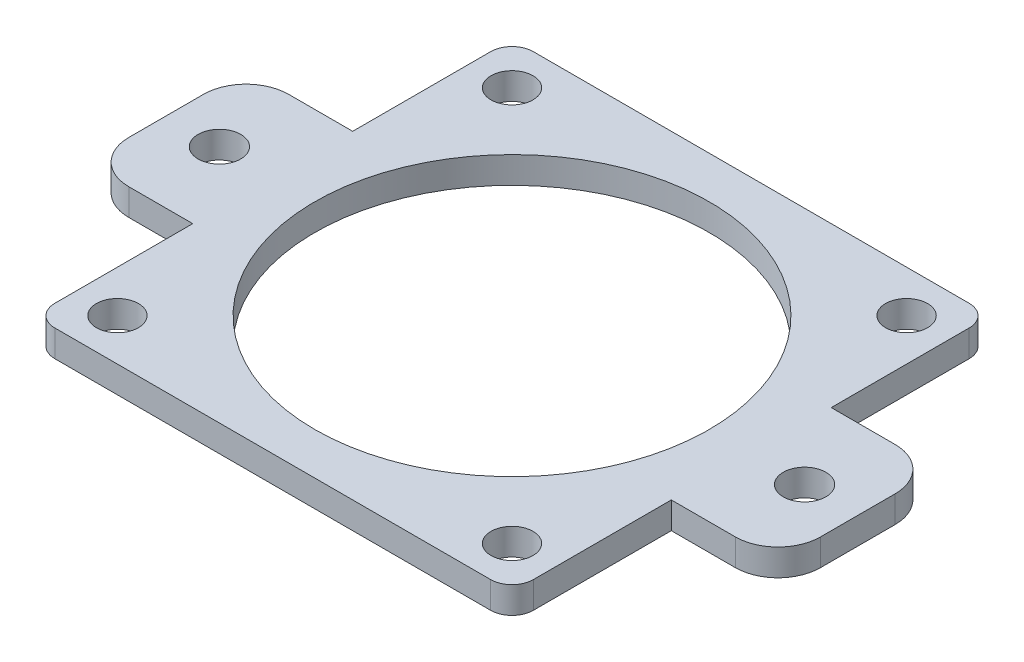
ISO-10303-21;
HEADER;
FILE_DESCRIPTION(('STEP AP214'),'2;1');
FILE_NAME('part.step','',(''),(''),'','','');
FILE_SCHEMA(('AUTOMOTIVE_DESIGN { 1 0 10303 214 1 1 1 1 }'));
ENDSEC;
DATA;
#1=APPLICATION_CONTEXT('core data for automotive mechanical design processes');
#2=APPLICATION_PROTOCOL_DEFINITION('international standard','automotive_design',2000,#1);
#3=PRODUCT_CONTEXT('',#1,'mechanical');
#4=PRODUCT('Part','Part','',(#3));
#5=PRODUCT_RELATED_PRODUCT_CATEGORY('part','',(#4));
#6=PRODUCT_DEFINITION_FORMATION('','',#4);
#7=PRODUCT_DEFINITION_CONTEXT('part definition',#1,'design');
#8=PRODUCT_DEFINITION('design','',#6,#7);
#9=PRODUCT_DEFINITION_SHAPE('','',#8);
#10=(LENGTH_UNIT() NAMED_UNIT(*) SI_UNIT(.MILLI.,.METRE.));
#11=(NAMED_UNIT(*) PLANE_ANGLE_UNIT() SI_UNIT($,.RADIAN.));
#12=(NAMED_UNIT(*) SI_UNIT($,.STERADIAN.) SOLID_ANGLE_UNIT());
#13=UNCERTAINTY_MEASURE_WITH_UNIT(LENGTH_MEASURE(1.E-05),#10,'distance_accuracy_value','');
#14=(GEOMETRIC_REPRESENTATION_CONTEXT(3) GLOBAL_UNCERTAINTY_ASSIGNED_CONTEXT((#13)) GLOBAL_UNIT_ASSIGNED_CONTEXT((#10,
#11,#12)) REPRESENTATION_CONTEXT('',''));
#15=CARTESIAN_POINT('',(0.,0.,0.));
#16=DIRECTION('',(0.,0.,1.));
#17=DIRECTION('',(1.,0.,0.));
#18=AXIS2_PLACEMENT_3D('',#15,#16,#17);
#19=CARTESIAN_POINT('',(25.9599938,3.175,-25.9599938));
#20=DIRECTION('',(0.,1.,0.));
#21=DIRECTION('',(0.,0.,1.));
#22=AXIS2_PLACEMENT_3D('',#19,#20,#21);
#23=PLANE('',#22);
#24=CARTESIAN_POINT('',(-34.8499938,3.175,0.));
#25=DIRECTION('',(0.,1.,0.));
#26=DIRECTION('',(0.,0.,1.));
#27=AXIS2_PLACEMENT_3D('',#24,#25,#26);
#28=CIRCLE('',#27,2.54);
#29=CARTESIAN_POINT('',(-34.8499938,3.175,2.54));
#30=VERTEX_POINT('',#29);
#31=EDGE_CURVE('E682',#30,#30,#28,.T.);
#32=ORIENTED_EDGE('',*,*,#31,.F.);
#33=EDGE_LOOP('',(#32));
#34=FACE_BOUND('',#33,.T.);
#35=CARTESIAN_POINT('',(23.5000038000013,3.175,23.5000037999987));
#36=DIRECTION('',(0.,1.,0.));
#37=DIRECTION('',(0.,0.,1.));
#38=AXIS2_PLACEMENT_3D('',#35,#36,#37);
#39=CIRCLE('',#38,2.49999500000186);
#40=CARTESIAN_POINT('',(23.5000038000013,3.175,25.9999988000005));
#41=VERTEX_POINT('',#40);
#42=EDGE_CURVE('E694',#41,#41,#39,.T.);
#43=ORIENTED_EDGE('',*,*,#42,.F.);
#44=EDGE_LOOP('',(#43));
#45=FACE_BOUND('',#44,.T.);
#46=CARTESIAN_POINT('',(-23.5000038,3.175,-23.5000038));
#47=DIRECTION('',(0.,1.,0.));
#48=DIRECTION('',(0.,0.,1.));
#49=AXIS2_PLACEMENT_3D('',#46,#47,#48);
#50=CIRCLE('',#49,2.499995);
#51=CARTESIAN_POINT('',(-23.5000038,3.175,-21.0000088));
#52=VERTEX_POINT('',#51);
#53=EDGE_CURVE('E706',#52,#52,#50,.T.);
#54=ORIENTED_EDGE('',*,*,#53,.F.);
#55=EDGE_LOOP('',(#54));
#56=FACE_BOUND('',#55,.T.);
#57=DIRECTION('',(-1.,0.,0.));
#58=VECTOR('',#57,1.);
#59=CARTESIAN_POINT('',(-13.9933145966194,3.175,-28.4999938));
#60=LINE('',#59,#58);
#61=CARTESIAN_POINT('',(25.9599938,3.175,-28.4999938));
#62=VERTEX_POINT('',#61);
#63=CARTESIAN_POINT('',(-25.9599938,3.175,-28.4999938));
#64=VERTEX_POINT('',#63);
#65=EDGE_CURVE('E52',#62,#64,#60,.T.);
#66=ORIENTED_EDGE('',*,*,#65,.T.);
#67=CARTESIAN_POINT('',(-25.9599938,3.175,-25.9599938));
#68=DIRECTION('',(0.,1.,0.));
#69=DIRECTION('',(0.,0.,1.));
#70=AXIS2_PLACEMENT_3D('',#67,#68,#69);
#71=CIRCLE('',#70,2.54);
#72=CARTESIAN_POINT('',(-28.4999938,3.175,-25.9599938));
#73=VERTEX_POINT('',#72);
#74=EDGE_CURVE('E299',#64,#73,#71,.T.);
#75=ORIENTED_EDGE('',*,*,#74,.T.);
#76=DIRECTION('',(0.,0.,1.));
#77=VECTOR('',#76,1.);
#78=CARTESIAN_POINT('',(-28.4999938,3.175,-13.9933145966194));
#79=LINE('',#78,#77);
#80=CARTESIAN_POINT('',(-28.4999938,3.175,-9.525));
#81=VERTEX_POINT('',#80);
#82=EDGE_CURVE('E296',#73,#81,#79,.T.);
#83=ORIENTED_EDGE('',*,*,#82,.T.);
#84=DIRECTION('',(-1.,0.,0.));
#85=VECTOR('',#84,1.);
#86=CARTESIAN_POINT('',(-28.4999938,3.175,-9.525));
#87=LINE('',#86,#85);
#88=CARTESIAN_POINT('',(-36.1199938,3.175,-9.525));
#89=VERTEX_POINT('',#88);
#90=EDGE_CURVE('E319',#81,#89,#87,.T.);
#91=ORIENTED_EDGE('',*,*,#90,.T.);
#92=CARTESIAN_POINT('',(-36.1199938,3.175,-4.445));
#93=DIRECTION('',(0.,1.,0.));
#94=DIRECTION('',(0.,0.,1.));
#95=AXIS2_PLACEMENT_3D('',#92,#93,#94);
#96=CIRCLE('',#95,5.08);
#97=CARTESIAN_POINT('',(-41.1999938,3.175,-4.44499999999996));
#98=VERTEX_POINT('',#97);
#99=EDGE_CURVE('E316',#89,#98,#96,.T.);
#100=ORIENTED_EDGE('',*,*,#99,.T.);
#101=DIRECTION('',(0.,0.,1.));
#102=VECTOR('',#101,1.);
#103=CARTESIAN_POINT('',(-41.1999938,3.175,4.44499999999997));
#104=LINE('',#103,#102);
#105=CARTESIAN_POINT('',(-41.1999938,3.175,4.44499999999997));
#106=VERTEX_POINT('',#105);
#107=EDGE_CURVE('E318',#98,#106,#104,.T.);
#108=ORIENTED_EDGE('',*,*,#107,.T.);
#109=CARTESIAN_POINT('',(-36.1199938,3.175,4.44500000000001));
#110=DIRECTION('',(0.,1.,0.));
#111=DIRECTION('',(0.,0.,-1.));
#112=AXIS2_PLACEMENT_3D('',#109,#110,#111);
#113=CIRCLE('',#112,5.08);
#114=CARTESIAN_POINT('',(-36.1199938,3.175,9.525));
#115=VERTEX_POINT('',#114);
#116=EDGE_CURVE('E321',#106,#115,#113,.T.);
#117=ORIENTED_EDGE('',*,*,#116,.T.);
#118=DIRECTION('',(1.,0.,0.));
#119=VECTOR('',#118,1.);
#120=CARTESIAN_POINT('',(-28.4999938,3.175,9.52500000000001));
#121=LINE('',#120,#119);
#122=CARTESIAN_POINT('',(-28.4999938,3.175,9.52500000000001));
#123=VERTEX_POINT('',#122);
#124=EDGE_CURVE('E327',#115,#123,#121,.T.);
#125=ORIENTED_EDGE('',*,*,#124,.T.);
#126=DIRECTION('',(0.,0.,1.));
#127=VECTOR('',#126,1.);
#128=CARTESIAN_POINT('',(-28.4999938,3.175,9.52500000000001));
#129=LINE('',#128,#127);
#130=CARTESIAN_POINT('',(-28.4999938,3.175,25.9599938));
#131=VERTEX_POINT('',#130);
#132=EDGE_CURVE('E329',#123,#131,#129,.T.);
#133=ORIENTED_EDGE('',*,*,#132,.T.);
#134=CARTESIAN_POINT('',(-25.9599938,3.175,25.9599938));
#135=DIRECTION('',(0.,1.,0.));
#136=DIRECTION('',(0.,0.,-1.));
#137=AXIS2_PLACEMENT_3D('',#134,#135,#136);
#138=CIRCLE('',#137,2.54);
#139=CARTESIAN_POINT('',(-25.9599938,3.175,28.4999938));
#140=VERTEX_POINT('',#139);
#141=EDGE_CURVE('E331',#131,#140,#138,.T.);
#142=ORIENTED_EDGE('',*,*,#141,.T.);
#143=DIRECTION('',(1.,0.,0.));
#144=VECTOR('',#143,1.);
#145=CARTESIAN_POINT('',(-13.9933145966194,3.175,28.4999938));
#146=LINE('',#145,#144);
#147=CARTESIAN_POINT('',(25.9599938,3.175,28.4999938));
#148=VERTEX_POINT('',#147);
#149=EDGE_CURVE('E333',#140,#148,#146,.T.);
#150=ORIENTED_EDGE('',*,*,#149,.T.);
#151=CARTESIAN_POINT('',(25.9599938,3.175,25.9599938));
#152=DIRECTION('',(0.,1.,0.));
#153=DIRECTION('',(0.,0.,1.));
#154=AXIS2_PLACEMENT_3D('',#151,#152,#153);
#155=CIRCLE('',#154,2.54);
#156=CARTESIAN_POINT('',(28.4999938,3.175,25.9599938));
#157=VERTEX_POINT('',#156);
#158=EDGE_CURVE('E335',#148,#157,#155,.T.);
#159=ORIENTED_EDGE('',*,*,#158,.T.);
#160=DIRECTION('',(0.,0.,-1.));
#161=VECTOR('',#160,1.);
#162=CARTESIAN_POINT('',(28.4999938,3.175,25.9599938));
#163=LINE('',#162,#161);
#164=CARTESIAN_POINT('',(28.4999938,3.175,9.525));
#165=VERTEX_POINT('',#164);
#166=EDGE_CURVE('E337',#157,#165,#163,.T.);
#167=ORIENTED_EDGE('',*,*,#166,.T.);
#168=DIRECTION('',(1.,0.,0.));
#169=VECTOR('',#168,1.);
#170=CARTESIAN_POINT('',(28.4999938,3.175,9.525));
#171=LINE('',#170,#169);
#172=CARTESIAN_POINT('',(36.1199938,3.175,9.525));
#173=VERTEX_POINT('',#172);
#174=EDGE_CURVE('E339',#165,#173,#171,.T.);
#175=ORIENTED_EDGE('',*,*,#174,.T.);
#176=CARTESIAN_POINT('',(36.1199938,3.175,4.445));
#177=DIRECTION('',(0.,1.,0.));
#178=DIRECTION('',(0.,0.,1.));
#179=AXIS2_PLACEMENT_3D('',#176,#177,#178);
#180=CIRCLE('',#179,5.08);
#181=CARTESIAN_POINT('',(41.1999938,3.175,4.44499999999996));
#182=VERTEX_POINT('',#181);
#183=EDGE_CURVE('E341',#173,#182,#180,.T.);
#184=ORIENTED_EDGE('',*,*,#183,.T.);
#185=DIRECTION('',(0.,0.,-1.));
#186=VECTOR('',#185,1.);
#187=CARTESIAN_POINT('',(41.1999938,3.175,4.44499999999996));
#188=LINE('',#187,#186);
#189=CARTESIAN_POINT('',(41.1999938,3.175,-4.44499999999998));
#190=VERTEX_POINT('',#189);
#191=EDGE_CURVE('E343',#182,#190,#188,.T.);
#192=ORIENTED_EDGE('',*,*,#191,.T.);
#193=CARTESIAN_POINT('',(36.1199938,3.175,-4.44500000000001));
#194=DIRECTION('',(0.,1.,0.));
#195=DIRECTION('',(0.,0.,1.));
#196=AXIS2_PLACEMENT_3D('',#193,#194,#195);
#197=CIRCLE('',#196,5.08);
#198=CARTESIAN_POINT('',(36.1199938,3.175,-9.52500000000001));
#199=VERTEX_POINT('',#198);
#200=EDGE_CURVE('E183',#190,#199,#197,.T.);
#201=ORIENTED_EDGE('',*,*,#200,.T.);
#202=DIRECTION('',(-1.,0.,0.));
#203=VECTOR('',#202,1.);
#204=CARTESIAN_POINT('',(28.4999938,3.175,-9.525));
#205=LINE('',#204,#203);
#206=CARTESIAN_POINT('',(28.4999938,3.175,-9.525));
#207=VERTEX_POINT('',#206);
#208=EDGE_CURVE('E177',#199,#207,#205,.T.);
#209=ORIENTED_EDGE('',*,*,#208,.T.);
#210=DIRECTION('',(0.,0.,-1.));
#211=VECTOR('',#210,1.);
#212=CARTESIAN_POINT('',(28.4999938,3.175,-13.9933145966194));
#213=LINE('',#212,#211);
#214=CARTESIAN_POINT('',(28.4999938,3.175,-25.9599938));
#215=VERTEX_POINT('',#214);
#216=EDGE_CURVE('E181',#207,#215,#213,.T.);
#217=ORIENTED_EDGE('',*,*,#216,.T.);
#218=CARTESIAN_POINT('',(25.9599938,3.175,-25.9599938));
#219=DIRECTION('',(0.,1.,0.));
#220=DIRECTION('',(0.,0.,1.));
#221=AXIS2_PLACEMENT_3D('',#218,#219,#220);
#222=CIRCLE('',#221,2.54);
#223=EDGE_CURVE('E198',#215,#62,#222,.T.);
#224=ORIENTED_EDGE('',*,*,#223,.T.);
#225=EDGE_LOOP('',(#66,#75,#83,#91,#100,#108,#117,#125,#133,#142,#150,#159,#167,#175,#184,#192,
#201,#209,#217,#224));
#226=FACE_BOUND('',#225,.T.);
#227=CARTESIAN_POINT('',(0.,3.175,0.));
#228=DIRECTION('',(0.,1.,0.));
#229=DIRECTION('',(0.,0.,1.));
#230=AXIS2_PLACEMENT_3D('',#227,#228,#229);
#231=CIRCLE('',#230,23.495);
#232=CARTESIAN_POINT('',(0.,3.175,23.495));
#233=VERTEX_POINT('',#232);
#234=EDGE_CURVE('E208',#233,#233,#231,.T.);
#235=ORIENTED_EDGE('',*,*,#234,.F.);
#236=EDGE_LOOP('',(#235));
#237=FACE_BOUND('',#236,.T.);
#238=CARTESIAN_POINT('',(23.5000038,3.175,-23.5000038000013));
#239=DIRECTION('',(0.,1.,0.));
#240=DIRECTION('',(0.,0.,1.));
#241=AXIS2_PLACEMENT_3D('',#238,#239,#240);
#242=CIRCLE('',#241,2.49999500000137);
#243=CARTESIAN_POINT('',(23.5000038,3.175,-21.0000088));
#244=VERTEX_POINT('',#243);
#245=EDGE_CURVE('E700',#244,#244,#242,.T.);
#246=ORIENTED_EDGE('',*,*,#245,.F.);
#247=EDGE_LOOP('',(#246));
#248=FACE_BOUND('',#247,.T.);
#249=CARTESIAN_POINT('',(-23.5000037999987,3.175,23.5000038));
#250=DIRECTION('',(0.,1.,0.));
#251=DIRECTION('',(0.,0.,1.));
#252=AXIS2_PLACEMENT_3D('',#249,#250,#251);
#253=CIRCLE('',#252,2.49999500000069);
#254=CARTESIAN_POINT('',(-23.5000037999987,3.175,25.9999988000007));
#255=VERTEX_POINT('',#254);
#256=EDGE_CURVE('E688',#255,#255,#253,.T.);
#257=ORIENTED_EDGE('',*,*,#256,.F.);
#258=EDGE_LOOP('',(#257));
#259=FACE_BOUND('',#258,.T.);
#260=CARTESIAN_POINT('',(34.8499938,3.175,0.));
#261=DIRECTION('',(0.,1.,0.));
#262=DIRECTION('',(0.,0.,-1.));
#263=AXIS2_PLACEMENT_3D('',#260,#261,#262);
#264=CIRCLE('',#263,2.54000000000002);
#265=CARTESIAN_POINT('',(34.8499938,3.175,-2.54000000000002));
#266=VERTEX_POINT('',#265);
#267=EDGE_CURVE('E673',#266,#266,#264,.T.);
#268=ORIENTED_EDGE('',*,*,#267,.F.);
#269=EDGE_LOOP('',(#268));
#270=FACE_BOUND('',#269,.T.);
#271=ADVANCED_FACE('F35',(#34,#45,#56,#226,#237,#248,#259,#270),#23,.T.);
#272=CARTESIAN_POINT('',(25.9599938,0.,-25.9599938));
#273=DIRECTION('',(0.,1.,0.));
#274=DIRECTION('',(0.,0.,1.));
#275=AXIS2_PLACEMENT_3D('',#272,#273,#274);
#276=PLANE('',#275);
#277=CARTESIAN_POINT('',(-25.9599938,0.,-25.9599938));
#278=DIRECTION('',(0.,1.,0.));
#279=DIRECTION('',(0.,0.,1.));
#280=AXIS2_PLACEMENT_3D('',#277,#278,#279);
#281=CIRCLE('',#280,2.54);
#282=CARTESIAN_POINT('',(-25.9599938,0.,-28.4999938));
#283=VERTEX_POINT('',#282);
#284=CARTESIAN_POINT('',(-28.4999938,0.,-25.9599938));
#285=VERTEX_POINT('',#284);
#286=EDGE_CURVE('E204',#283,#285,#281,.T.);
#287=ORIENTED_EDGE('',*,*,#286,.F.);
#288=DIRECTION('',(-1.,0.,0.));
#289=VECTOR('',#288,1.);
#290=CARTESIAN_POINT('',(25.9599938,0.,-28.4999938));
#291=LINE('',#290,#289);
#292=CARTESIAN_POINT('',(25.9599938,0.,-28.4999938));
#293=VERTEX_POINT('',#292);
#294=EDGE_CURVE('E244',#293,#283,#291,.T.);
#295=ORIENTED_EDGE('',*,*,#294,.F.);
#296=CARTESIAN_POINT('',(25.9599938,0.,-25.9599938));
#297=DIRECTION('',(0.,1.,0.));
#298=DIRECTION('',(0.,0.,1.));
#299=AXIS2_PLACEMENT_3D('',#296,#297,#298);
#300=CIRCLE('',#299,2.54);
#301=CARTESIAN_POINT('',(28.4999938,0.,-25.9599938));
#302=VERTEX_POINT('',#301);
#303=EDGE_CURVE('E124',#302,#293,#300,.T.);
#304=ORIENTED_EDGE('',*,*,#303,.F.);
#305=DIRECTION('',(0.,0.,-1.));
#306=VECTOR('',#305,1.);
#307=CARTESIAN_POINT('',(28.4999938,0.,-13.9933145966194));
#308=LINE('',#307,#306);
#309=CARTESIAN_POINT('',(28.4999938,0.,-9.525));
#310=VERTEX_POINT('',#309);
#311=EDGE_CURVE('E117',#310,#302,#308,.T.);
#312=ORIENTED_EDGE('',*,*,#311,.F.);
#313=DIRECTION('',(-1.,0.,0.));
#314=VECTOR('',#313,1.);
#315=CARTESIAN_POINT('',(28.4999938,0.,-9.525));
#316=LINE('',#315,#314);
#317=CARTESIAN_POINT('',(36.1199938,0.,-9.52500000000001));
#318=VERTEX_POINT('',#317);
#319=EDGE_CURVE('E192',#318,#310,#316,.T.);
#320=ORIENTED_EDGE('',*,*,#319,.F.);
#321=CARTESIAN_POINT('',(36.1199938,0.,-4.44500000000001));
#322=DIRECTION('',(0.,1.,0.));
#323=DIRECTION('',(0.,0.,1.));
#324=AXIS2_PLACEMENT_3D('',#321,#322,#323);
#325=CIRCLE('',#324,5.08);
#326=CARTESIAN_POINT('',(41.1999938,0.,-4.44499999999998));
#327=VERTEX_POINT('',#326);
#328=EDGE_CURVE('E239',#327,#318,#325,.T.);
#329=ORIENTED_EDGE('',*,*,#328,.F.);
#330=DIRECTION('',(0.,0.,-1.));
#331=VECTOR('',#330,1.);
#332=CARTESIAN_POINT('',(41.1999938,0.,4.44499999999996));
#333=LINE('',#332,#331);
#334=CARTESIAN_POINT('',(41.1999938,0.,4.44499999999996));
#335=VERTEX_POINT('',#334);
#336=EDGE_CURVE('E237',#335,#327,#333,.T.);
#337=ORIENTED_EDGE('',*,*,#336,.F.);
#338=CARTESIAN_POINT('',(36.1199938,0.,4.445));
#339=DIRECTION('',(0.,1.,0.));
#340=DIRECTION('',(0.,0.,1.));
#341=AXIS2_PLACEMENT_3D('',#338,#339,#340);
#342=CIRCLE('',#341,5.08);
#343=CARTESIAN_POINT('',(36.1199938,0.,9.525));
#344=VERTEX_POINT('',#343);
#345=EDGE_CURVE('E235',#344,#335,#342,.T.);
#346=ORIENTED_EDGE('',*,*,#345,.F.);
#347=DIRECTION('',(1.,0.,0.));
#348=VECTOR('',#347,1.);
#349=CARTESIAN_POINT('',(28.4999938,0.,9.525));
#350=LINE('',#349,#348);
#351=CARTESIAN_POINT('',(28.4999938,0.,9.525));
#352=VERTEX_POINT('',#351);
#353=EDGE_CURVE('E233',#352,#344,#350,.T.);
#354=ORIENTED_EDGE('',*,*,#353,.F.);
#355=DIRECTION('',(0.,0.,-1.));
#356=VECTOR('',#355,1.);
#357=CARTESIAN_POINT('',(28.4999938,0.,9.525));
#358=LINE('',#357,#356);
#359=CARTESIAN_POINT('',(28.4999938,0.,25.9599938));
#360=VERTEX_POINT('',#359);
#361=EDGE_CURVE('E231',#360,#352,#358,.T.);
#362=ORIENTED_EDGE('',*,*,#361,.F.);
#363=CARTESIAN_POINT('',(25.9599938,0.,25.9599938));
#364=DIRECTION('',(0.,1.,0.));
#365=DIRECTION('',(0.,0.,1.));
#366=AXIS2_PLACEMENT_3D('',#363,#364,#365);
#367=CIRCLE('',#366,2.54);
#368=CARTESIAN_POINT('',(25.9599938,0.,28.4999938));
#369=VERTEX_POINT('',#368);
#370=EDGE_CURVE('E228',#369,#360,#367,.T.);
#371=ORIENTED_EDGE('',*,*,#370,.F.);
#372=DIRECTION('',(1.,0.,0.));
#373=VECTOR('',#372,1.);
#374=CARTESIAN_POINT('',(25.9599938,0.,28.4999938));
#375=LINE('',#374,#373);
#376=CARTESIAN_POINT('',(-25.9599938,0.,28.4999938));
#377=VERTEX_POINT('',#376);
#378=EDGE_CURVE('E226',#377,#369,#375,.T.);
#379=ORIENTED_EDGE('',*,*,#378,.F.);
#380=CARTESIAN_POINT('',(-25.9599938,0.,25.9599938));
#381=DIRECTION('',(0.,1.,0.));
#382=DIRECTION('',(0.,0.,-1.));
#383=AXIS2_PLACEMENT_3D('',#380,#381,#382);
#384=CIRCLE('',#383,2.54);
#385=CARTESIAN_POINT('',(-28.4999938,0.,25.9599938));
#386=VERTEX_POINT('',#385);
#387=EDGE_CURVE('E223',#386,#377,#384,.T.);
#388=ORIENTED_EDGE('',*,*,#387,.F.);
#389=DIRECTION('',(0.,0.,1.));
#390=VECTOR('',#389,1.);
#391=CARTESIAN_POINT('',(-28.4999938,0.,25.9599938));
#392=LINE('',#391,#390);
#393=CARTESIAN_POINT('',(-28.4999938,0.,9.52500000000001));
#394=VERTEX_POINT('',#393);
#395=EDGE_CURVE('E221',#394,#386,#392,.T.);
#396=ORIENTED_EDGE('',*,*,#395,.F.);
#397=DIRECTION('',(1.,0.,0.));
#398=VECTOR('',#397,1.);
#399=CARTESIAN_POINT('',(-28.4999938,0.,9.52500000000001));
#400=LINE('',#399,#398);
#401=CARTESIAN_POINT('',(-36.1199938,0.,9.525));
#402=VERTEX_POINT('',#401);
#403=EDGE_CURVE('E218',#402,#394,#400,.T.);
#404=ORIENTED_EDGE('',*,*,#403,.F.);
#405=CARTESIAN_POINT('',(-36.1199938,0.,4.44500000000001));
#406=DIRECTION('',(0.,1.,0.));
#407=DIRECTION('',(0.,0.,-1.));
#408=AXIS2_PLACEMENT_3D('',#405,#406,#407);
#409=CIRCLE('',#408,5.08);
#410=CARTESIAN_POINT('',(-41.1999938,0.,4.44499999999997));
#411=VERTEX_POINT('',#410);
#412=EDGE_CURVE('E216',#411,#402,#409,.T.);
#413=ORIENTED_EDGE('',*,*,#412,.F.);
#414=DIRECTION('',(0.,0.,1.));
#415=VECTOR('',#414,1.);
#416=CARTESIAN_POINT('',(-41.1999938,0.,4.44499999999997));
#417=LINE('',#416,#415);
#418=CARTESIAN_POINT('',(-41.1999938,0.,-4.44499999999996));
#419=VERTEX_POINT('',#418);
#420=EDGE_CURVE('E214',#419,#411,#417,.T.);
#421=ORIENTED_EDGE('',*,*,#420,.F.);
#422=CARTESIAN_POINT('',(-36.1199938,0.,-4.445));
#423=DIRECTION('',(0.,1.,0.));
#424=DIRECTION('',(0.,0.,1.));
#425=AXIS2_PLACEMENT_3D('',#422,#423,#424);
#426=CIRCLE('',#425,5.08);
#427=CARTESIAN_POINT('',(-36.1199938,0.,-9.525));
#428=VERTEX_POINT('',#427);
#429=EDGE_CURVE('E212',#428,#419,#426,.T.);
#430=ORIENTED_EDGE('',*,*,#429,.F.);
#431=DIRECTION('',(-1.,0.,0.));
#432=VECTOR('',#431,1.);
#433=CARTESIAN_POINT('',(-28.4999938,0.,-9.525));
#434=LINE('',#433,#432);
#435=CARTESIAN_POINT('',(-28.4999938,0.,-9.525));
#436=VERTEX_POINT('',#435);
#437=EDGE_CURVE('E210',#436,#428,#434,.T.);
#438=ORIENTED_EDGE('',*,*,#437,.F.);
#439=DIRECTION('',(0.,0.,1.));
#440=VECTOR('',#439,1.);
#441=CARTESIAN_POINT('',(-28.4999938,0.,-13.9933145966194));
#442=LINE('',#441,#440);
#443=EDGE_CURVE('E207',#285,#436,#442,.T.);
#444=ORIENTED_EDGE('',*,*,#443,.F.);
#445=EDGE_LOOP('',(#287,#295,#304,#312,#320,#329,#337,#346,#354,#362,#371,#379,#388,#396,#404,
#413,#421,#430,#438,#444));
#446=FACE_BOUND('',#445,.T.);
#447=CARTESIAN_POINT('',(0.,0.,0.));
#448=DIRECTION('',(0.,1.,0.));
#449=DIRECTION('',(0.,0.,1.));
#450=AXIS2_PLACEMENT_3D('',#447,#448,#449);
#451=CIRCLE('',#450,23.495);
#452=CARTESIAN_POINT('',(0.,0.,23.495));
#453=VERTEX_POINT('',#452);
#454=EDGE_CURVE('E709',#453,#453,#451,.T.);
#455=ORIENTED_EDGE('',*,*,#454,.T.);
#456=EDGE_LOOP('',(#455));
#457=FACE_BOUND('',#456,.T.);
#458=CARTESIAN_POINT('',(-23.5000038,0.,-23.5000038));
#459=DIRECTION('',(0.,1.,0.));
#460=DIRECTION('',(0.,0.,1.));
#461=AXIS2_PLACEMENT_3D('',#458,#459,#460);
#462=CIRCLE('',#461,2.499995);
#463=CARTESIAN_POINT('',(-23.5000038,0.,-21.0000088));
#464=VERTEX_POINT('',#463);
#465=EDGE_CURVE('E703',#464,#464,#462,.T.);
#466=ORIENTED_EDGE('',*,*,#465,.T.);
#467=EDGE_LOOP('',(#466));
#468=FACE_BOUND('',#467,.T.);
#469=CARTESIAN_POINT('',(23.5000038,0.,-23.5000038000013));
#470=DIRECTION('',(0.,1.,0.));
#471=DIRECTION('',(0.,0.,1.));
#472=AXIS2_PLACEMENT_3D('',#469,#470,#471);
#473=CIRCLE('',#472,2.49999500000137);
#474=CARTESIAN_POINT('',(23.5000038,0.,-21.0000088));
#475=VERTEX_POINT('',#474);
#476=EDGE_CURVE('E697',#475,#475,#473,.T.);
#477=ORIENTED_EDGE('',*,*,#476,.T.);
#478=EDGE_LOOP('',(#477));
#479=FACE_BOUND('',#478,.T.);
#480=CARTESIAN_POINT('',(23.5000038000013,0.,23.5000037999987));
#481=DIRECTION('',(0.,1.,0.));
#482=DIRECTION('',(0.,0.,1.));
#483=AXIS2_PLACEMENT_3D('',#480,#481,#482);
#484=CIRCLE('',#483,2.49999500000186);
#485=CARTESIAN_POINT('',(23.5000038000013,0.,25.9999988000005));
#486=VERTEX_POINT('',#485);
#487=EDGE_CURVE('E691',#486,#486,#484,.T.);
#488=ORIENTED_EDGE('',*,*,#487,.T.);
#489=EDGE_LOOP('',(#488));
#490=FACE_BOUND('',#489,.T.);
#491=CARTESIAN_POINT('',(-23.5000037999987,0.,23.5000038));
#492=DIRECTION('',(0.,1.,0.));
#493=DIRECTION('',(0.,0.,1.));
#494=AXIS2_PLACEMENT_3D('',#491,#492,#493);
#495=CIRCLE('',#494,2.49999500000069);
#496=CARTESIAN_POINT('',(-23.5000037999987,0.,25.9999988000007));
#497=VERTEX_POINT('',#496);
#498=EDGE_CURVE('E685',#497,#497,#495,.T.);
#499=ORIENTED_EDGE('',*,*,#498,.T.);
#500=EDGE_LOOP('',(#499));
#501=FACE_BOUND('',#500,.T.);
#502=CARTESIAN_POINT('',(-34.8499938,0.,0.));
#503=DIRECTION('',(0.,1.,0.));
#504=DIRECTION('',(0.,0.,1.));
#505=AXIS2_PLACEMENT_3D('',#502,#503,#504);
#506=CIRCLE('',#505,2.54);
#507=CARTESIAN_POINT('',(-34.8499938,0.,2.54));
#508=VERTEX_POINT('',#507);
#509=EDGE_CURVE('E679',#508,#508,#506,.T.);
#510=ORIENTED_EDGE('',*,*,#509,.T.);
#511=EDGE_LOOP('',(#510));
#512=FACE_BOUND('',#511,.T.);
#513=CARTESIAN_POINT('',(34.8499938,0.,0.));
#514=DIRECTION('',(0.,1.,0.));
#515=DIRECTION('',(0.,0.,-1.));
#516=AXIS2_PLACEMENT_3D('',#513,#514,#515);
#517=CIRCLE('',#516,2.54000000000002);
#518=CARTESIAN_POINT('',(34.8499938,0.,-2.54000000000002));
#519=VERTEX_POINT('',#518);
#520=EDGE_CURVE('E676',#519,#519,#517,.T.);
#521=ORIENTED_EDGE('',*,*,#520,.T.);
#522=EDGE_LOOP('',(#521));
#523=FACE_BOUND('',#522,.T.);
#524=ADVANCED_FACE('F303',(#446,#457,#468,#479,#490,#501,#512,#523),#276,.F.);
#525=CARTESIAN_POINT('',(-25.9599938,3.175,-25.9599938));
#526=DIRECTION('',(0.,-1.,0.));
#527=DIRECTION('',(0.,0.,-1.));
#528=AXIS2_PLACEMENT_3D('',#525,#526,#527);
#529=CYLINDRICAL_SURFACE('',#528,2.54);
#530=ORIENTED_EDGE('',*,*,#286,.T.);
#531=DIRECTION('',(0.,-1.,0.));
#532=VECTOR('',#531,1.);
#533=CARTESIAN_POINT('',(-28.4999938,3.175,-25.9599938));
#534=LINE('',#533,#532);
#535=EDGE_CURVE('E44',#73,#285,#534,.T.);
#536=ORIENTED_EDGE('',*,*,#535,.F.);
#537=ORIENTED_EDGE('',*,*,#74,.F.);
#538=DIRECTION('',(0.,-1.,0.));
#539=VECTOR('',#538,1.);
#540=CARTESIAN_POINT('',(-25.9599938,3.175,-28.4999938));
#541=LINE('',#540,#539);
#542=EDGE_CURVE('E11',#64,#283,#541,.T.);
#543=ORIENTED_EDGE('',*,*,#542,.T.);
#544=EDGE_LOOP('',(#530,#536,#537,#543));
#545=FACE_BOUND('',#544,.T.);
#546=ADVANCED_FACE('F37',(#545),#529,.T.);
#547=CARTESIAN_POINT('',(-28.4999938,3.175,-13.9933145966194));
#548=DIRECTION('',(1.,0.,0.));
#549=DIRECTION('',(0.,0.,-1.));
#550=AXIS2_PLACEMENT_3D('',#547,#548,#549);
#551=PLANE('',#550);
#552=ORIENTED_EDGE('',*,*,#443,.T.);
#553=DIRECTION('',(0.,-1.,0.));
#554=VECTOR('',#553,1.);
#555=CARTESIAN_POINT('',(-28.4999938,3.175,-9.525));
#556=LINE('',#555,#554);
#557=EDGE_CURVE('E288',#81,#436,#556,.T.);
#558=ORIENTED_EDGE('',*,*,#557,.F.);
#559=ORIENTED_EDGE('',*,*,#82,.F.);
#560=ORIENTED_EDGE('',*,*,#535,.T.);
#561=EDGE_LOOP('',(#552,#558,#559,#560));
#562=FACE_BOUND('',#561,.T.);
#563=ADVANCED_FACE('F294',(#562),#551,.F.);
#564=CARTESIAN_POINT('',(-28.4999938,3.175,-9.525));
#565=DIRECTION('',(0.,0.,1.));
#566=DIRECTION('',(1.,0.,0.));
#567=AXIS2_PLACEMENT_3D('',#564,#565,#566);
#568=PLANE('',#567);
#569=ORIENTED_EDGE('',*,*,#437,.T.);
#570=DIRECTION('',(0.,-1.,0.));
#571=VECTOR('',#570,1.);
#572=CARTESIAN_POINT('',(-36.1199938,3.175,-9.525));
#573=LINE('',#572,#571);
#574=EDGE_CURVE('E285',#89,#428,#573,.T.);
#575=ORIENTED_EDGE('',*,*,#574,.F.);
#576=ORIENTED_EDGE('',*,*,#90,.F.);
#577=ORIENTED_EDGE('',*,*,#557,.T.);
#578=EDGE_LOOP('',(#569,#575,#576,#577));
#579=FACE_BOUND('',#578,.T.);
#580=ADVANCED_FACE('F310',(#579),#568,.F.);
#581=CARTESIAN_POINT('',(-36.1199938,3.175,-4.445));
#582=DIRECTION('',(0.,-1.,0.));
#583=DIRECTION('',(0.,0.,-1.));
#584=AXIS2_PLACEMENT_3D('',#581,#582,#583);
#585=CYLINDRICAL_SURFACE('',#584,5.08);
#586=ORIENTED_EDGE('',*,*,#429,.T.);
#587=DIRECTION('',(0.,-1.,0.));
#588=VECTOR('',#587,1.);
#589=CARTESIAN_POINT('',(-41.1999938,3.175,-4.44499999999996));
#590=LINE('',#589,#588);
#591=EDGE_CURVE('E282',#98,#419,#590,.T.);
#592=ORIENTED_EDGE('',*,*,#591,.F.);
#593=ORIENTED_EDGE('',*,*,#99,.F.);
#594=ORIENTED_EDGE('',*,*,#574,.T.);
#595=EDGE_LOOP('',(#586,#592,#593,#594));
#596=FACE_BOUND('',#595,.T.);
#597=ADVANCED_FACE('F314',(#596),#585,.T.);
#598=CARTESIAN_POINT('',(-41.1999938,3.175,4.44499999999997));
#599=DIRECTION('',(1.,0.,0.));
#600=DIRECTION('',(0.,0.,-1.));
#601=AXIS2_PLACEMENT_3D('',#598,#599,#600);
#602=PLANE('',#601);
#603=ORIENTED_EDGE('',*,*,#420,.T.);
#604=DIRECTION('',(0.,-1.,0.));
#605=VECTOR('',#604,1.);
#606=CARTESIAN_POINT('',(-41.1999938,3.175,4.44499999999997));
#607=LINE('',#606,#605);
#608=EDGE_CURVE('E279',#106,#411,#607,.T.);
#609=ORIENTED_EDGE('',*,*,#608,.F.);
#610=ORIENTED_EDGE('',*,*,#107,.F.);
#611=ORIENTED_EDGE('',*,*,#591,.T.);
#612=EDGE_LOOP('',(#603,#609,#610,#611));
#613=FACE_BOUND('',#612,.T.);
#614=ADVANCED_FACE('F396',(#613),#602,.F.);
#615=CARTESIAN_POINT('',(-36.1199938,3.175,4.44500000000001));
#616=DIRECTION('',(0.,-1.,0.));
#617=DIRECTION('',(0.,0.,-1.));
#618=AXIS2_PLACEMENT_3D('',#615,#616,#617);
#619=CYLINDRICAL_SURFACE('',#618,5.08);
#620=ORIENTED_EDGE('',*,*,#412,.T.);
#621=DIRECTION('',(0.,-1.,0.));
#622=VECTOR('',#621,1.);
#623=CARTESIAN_POINT('',(-36.1199938,3.175,9.525));
#624=LINE('',#623,#622);
#625=EDGE_CURVE('E276',#115,#402,#624,.T.);
#626=ORIENTED_EDGE('',*,*,#625,.F.);
#627=ORIENTED_EDGE('',*,*,#116,.F.);
#628=ORIENTED_EDGE('',*,*,#608,.T.);
#629=EDGE_LOOP('',(#620,#626,#627,#628));
#630=FACE_BOUND('',#629,.T.);
#631=ADVANCED_FACE('F393',(#630),#619,.T.);
#632=CARTESIAN_POINT('',(-28.4999938,3.175,9.52500000000001));
#633=DIRECTION('',(0.,0.,-1.));
#634=DIRECTION('',(-1.,0.,0.));
#635=AXIS2_PLACEMENT_3D('',#632,#633,#634);
#636=PLANE('',#635);
#637=ORIENTED_EDGE('',*,*,#403,.T.);
#638=DIRECTION('',(0.,-1.,0.));
#639=VECTOR('',#638,1.);
#640=CARTESIAN_POINT('',(-28.4999938,3.175,9.52500000000001));
#641=LINE('',#640,#639);
#642=EDGE_CURVE('E273',#123,#394,#641,.T.);
#643=ORIENTED_EDGE('',*,*,#642,.F.);
#644=ORIENTED_EDGE('',*,*,#124,.F.);
#645=ORIENTED_EDGE('',*,*,#625,.T.);
#646=EDGE_LOOP('',(#637,#643,#644,#645));
#647=FACE_BOUND('',#646,.T.);
#648=ADVANCED_FACE('F388',(#647),#636,.F.);
#649=CARTESIAN_POINT('',(-28.4999938,3.175,25.9599938));
#650=DIRECTION('',(1.,0.,0.));
#651=DIRECTION('',(0.,0.,-1.));
#652=AXIS2_PLACEMENT_3D('',#649,#650,#651);
#653=PLANE('',#652);
#654=ORIENTED_EDGE('',*,*,#395,.T.);
#655=DIRECTION('',(0.,-1.,0.));
#656=VECTOR('',#655,1.);
#657=CARTESIAN_POINT('',(-28.4999938,3.175,25.9599938));
#658=LINE('',#657,#656);
#659=EDGE_CURVE('E270',#131,#386,#658,.T.);
#660=ORIENTED_EDGE('',*,*,#659,.F.);
#661=ORIENTED_EDGE('',*,*,#132,.F.);
#662=ORIENTED_EDGE('',*,*,#642,.T.);
#663=EDGE_LOOP('',(#654,#660,#661,#662));
#664=FACE_BOUND('',#663,.T.);
#665=ADVANCED_FACE('F383',(#664),#653,.F.);
#666=CARTESIAN_POINT('',(-25.9599938,3.175,25.9599938));
#667=DIRECTION('',(0.,-1.,0.));
#668=DIRECTION('',(0.,0.,-1.));
#669=AXIS2_PLACEMENT_3D('',#666,#667,#668);
#670=CYLINDRICAL_SURFACE('',#669,2.54);
#671=ORIENTED_EDGE('',*,*,#387,.T.);
#672=DIRECTION('',(0.,-1.,0.));
#673=VECTOR('',#672,1.);
#674=CARTESIAN_POINT('',(-25.9599938,3.175,28.4999938));
#675=LINE('',#674,#673);
#676=EDGE_CURVE('E267',#140,#377,#675,.T.);
#677=ORIENTED_EDGE('',*,*,#676,.F.);
#678=ORIENTED_EDGE('',*,*,#141,.F.);
#679=ORIENTED_EDGE('',*,*,#659,.T.);
#680=EDGE_LOOP('',(#671,#677,#678,#679));
#681=FACE_BOUND('',#680,.T.);
#682=ADVANCED_FACE('F378',(#681),#670,.T.);
#683=CARTESIAN_POINT('',(25.9599938,3.175,28.4999938));
#684=DIRECTION('',(0.,0.,-1.));
#685=DIRECTION('',(-1.,0.,0.));
#686=AXIS2_PLACEMENT_3D('',#683,#684,#685);
#687=PLANE('',#686);
#688=ORIENTED_EDGE('',*,*,#378,.T.);
#689=DIRECTION('',(0.,-1.,0.));
#690=VECTOR('',#689,1.);
#691=CARTESIAN_POINT('',(25.9599938,3.175,28.4999938));
#692=LINE('',#691,#690);
#693=EDGE_CURVE('E264',#148,#369,#692,.T.);
#694=ORIENTED_EDGE('',*,*,#693,.F.);
#695=ORIENTED_EDGE('',*,*,#149,.F.);
#696=ORIENTED_EDGE('',*,*,#676,.T.);
#697=EDGE_LOOP('',(#688,#694,#695,#696));
#698=FACE_BOUND('',#697,.T.);
#699=ADVANCED_FACE('F374',(#698),#687,.F.);
#700=CARTESIAN_POINT('',(25.9599938,3.175,25.9599938));
#701=DIRECTION('',(0.,-1.,0.));
#702=DIRECTION('',(0.,0.,-1.));
#703=AXIS2_PLACEMENT_3D('',#700,#701,#702);
#704=CYLINDRICAL_SURFACE('',#703,2.54);
#705=ORIENTED_EDGE('',*,*,#370,.T.);
#706=DIRECTION('',(0.,-1.,0.));
#707=VECTOR('',#706,1.);
#708=CARTESIAN_POINT('',(28.4999938,3.175,25.9599938));
#709=LINE('',#708,#707);
#710=EDGE_CURVE('E261',#157,#360,#709,.T.);
#711=ORIENTED_EDGE('',*,*,#710,.F.);
#712=ORIENTED_EDGE('',*,*,#158,.F.);
#713=ORIENTED_EDGE('',*,*,#693,.T.);
#714=EDGE_LOOP('',(#705,#711,#712,#713));
#715=FACE_BOUND('',#714,.T.);
#716=ADVANCED_FACE('F369',(#715),#704,.T.);
#717=CARTESIAN_POINT('',(28.4999938,3.175,9.525));
#718=DIRECTION('',(-1.,0.,0.));
#719=DIRECTION('',(0.,0.,1.));
#720=AXIS2_PLACEMENT_3D('',#717,#718,#719);
#721=PLANE('',#720);
#722=ORIENTED_EDGE('',*,*,#361,.T.);
#723=DIRECTION('',(0.,-1.,0.));
#724=VECTOR('',#723,1.);
#725=CARTESIAN_POINT('',(28.4999938,3.175,9.525));
#726=LINE('',#725,#724);
#727=EDGE_CURVE('E258',#165,#352,#726,.T.);
#728=ORIENTED_EDGE('',*,*,#727,.F.);
#729=ORIENTED_EDGE('',*,*,#166,.F.);
#730=ORIENTED_EDGE('',*,*,#710,.T.);
#731=EDGE_LOOP('',(#722,#728,#729,#730));
#732=FACE_BOUND('',#731,.T.);
#733=ADVANCED_FACE('F365',(#732),#721,.F.);
#734=CARTESIAN_POINT('',(28.4999938,3.175,9.525));
#735=DIRECTION('',(0.,0.,-1.));
#736=DIRECTION('',(-1.,0.,0.));
#737=AXIS2_PLACEMENT_3D('',#734,#735,#736);
#738=PLANE('',#737);
#739=ORIENTED_EDGE('',*,*,#353,.T.);
#740=DIRECTION('',(0.,-1.,0.));
#741=VECTOR('',#740,1.);
#742=CARTESIAN_POINT('',(36.1199938,3.175,9.525));
#743=LINE('',#742,#741);
#744=EDGE_CURVE('E255',#173,#344,#743,.T.);
#745=ORIENTED_EDGE('',*,*,#744,.F.);
#746=ORIENTED_EDGE('',*,*,#174,.F.);
#747=ORIENTED_EDGE('',*,*,#727,.T.);
#748=EDGE_LOOP('',(#739,#745,#746,#747));
#749=FACE_BOUND('',#748,.T.);
#750=ADVANCED_FACE('F361',(#749),#738,.F.);
#751=CARTESIAN_POINT('',(36.1199938,3.175,4.445));
#752=DIRECTION('',(0.,-1.,0.));
#753=DIRECTION('',(0.,0.,-1.));
#754=AXIS2_PLACEMENT_3D('',#751,#752,#753);
#755=CYLINDRICAL_SURFACE('',#754,5.08);
#756=ORIENTED_EDGE('',*,*,#345,.T.);
#757=DIRECTION('',(0.,-1.,0.));
#758=VECTOR('',#757,1.);
#759=CARTESIAN_POINT('',(41.1999938,3.175,4.44499999999996));
#760=LINE('',#759,#758);
#761=EDGE_CURVE('E252',#182,#335,#760,.T.);
#762=ORIENTED_EDGE('',*,*,#761,.F.);
#763=ORIENTED_EDGE('',*,*,#183,.F.);
#764=ORIENTED_EDGE('',*,*,#744,.T.);
#765=EDGE_LOOP('',(#756,#762,#763,#764));
#766=FACE_BOUND('',#765,.T.);
#767=ADVANCED_FACE('F357',(#766),#755,.T.);
#768=CARTESIAN_POINT('',(41.1999938,3.175,4.44499999999996));
#769=DIRECTION('',(-1.,0.,0.));
#770=DIRECTION('',(0.,0.,1.));
#771=AXIS2_PLACEMENT_3D('',#768,#769,#770);
#772=PLANE('',#771);
#773=ORIENTED_EDGE('',*,*,#336,.T.);
#774=DIRECTION('',(0.,-1.,0.));
#775=VECTOR('',#774,1.);
#776=CARTESIAN_POINT('',(41.1999938,3.175,-4.44499999999998));
#777=LINE('',#776,#775);
#778=EDGE_CURVE('E249',#190,#327,#777,.T.);
#779=ORIENTED_EDGE('',*,*,#778,.F.);
#780=ORIENTED_EDGE('',*,*,#191,.F.);
#781=ORIENTED_EDGE('',*,*,#761,.T.);
#782=EDGE_LOOP('',(#773,#779,#780,#781));
#783=FACE_BOUND('',#782,.T.);
#784=ADVANCED_FACE('F349',(#783),#772,.F.);
#785=CARTESIAN_POINT('',(36.1199938,3.175,-4.44500000000001));
#786=DIRECTION('',(0.,-1.,0.));
#787=DIRECTION('',(0.,0.,-1.));
#788=AXIS2_PLACEMENT_3D('',#785,#786,#787);
#789=CYLINDRICAL_SURFACE('',#788,5.08);
#790=ORIENTED_EDGE('',*,*,#328,.T.);
#791=DIRECTION('',(0.,-1.,0.));
#792=VECTOR('',#791,1.);
#793=CARTESIAN_POINT('',(36.1199938,3.175,-9.52500000000001));
#794=LINE('',#793,#792);
#795=EDGE_CURVE('E193',#199,#318,#794,.T.);
#796=ORIENTED_EDGE('',*,*,#795,.F.);
#797=ORIENTED_EDGE('',*,*,#200,.F.);
#798=ORIENTED_EDGE('',*,*,#778,.T.);
#799=EDGE_LOOP('',(#790,#796,#797,#798));
#800=FACE_BOUND('',#799,.T.);
#801=ADVANCED_FACE('F353',(#800),#789,.T.);
#802=CARTESIAN_POINT('',(28.4999938,3.175,-9.525));
#803=DIRECTION('',(0.,0.,1.));
#804=DIRECTION('',(1.,0.,0.));
#805=AXIS2_PLACEMENT_3D('',#802,#803,#804);
#806=PLANE('',#805);
#807=ORIENTED_EDGE('',*,*,#319,.T.);
#808=DIRECTION('',(0.,-1.,0.));
#809=VECTOR('',#808,1.);
#810=CARTESIAN_POINT('',(28.4999938,3.175,-9.525));
#811=LINE('',#810,#809);
#812=EDGE_CURVE('E189',#207,#310,#811,.T.);
#813=ORIENTED_EDGE('',*,*,#812,.F.);
#814=ORIENTED_EDGE('',*,*,#208,.F.);
#815=ORIENTED_EDGE('',*,*,#795,.T.);
#816=EDGE_LOOP('',(#807,#813,#814,#815));
#817=FACE_BOUND('',#816,.T.);
#818=ADVANCED_FACE('F190',(#817),#806,.F.);
#819=CARTESIAN_POINT('',(28.4999938,3.175,-13.9933145966194));
#820=DIRECTION('',(-1.,0.,0.));
#821=DIRECTION('',(0.,0.,1.));
#822=AXIS2_PLACEMENT_3D('',#819,#820,#821);
#823=PLANE('',#822);
#824=ORIENTED_EDGE('',*,*,#311,.T.);
#825=DIRECTION('',(0.,-1.,0.));
#826=VECTOR('',#825,1.);
#827=CARTESIAN_POINT('',(28.4999938,3.175,-25.9599938));
#828=LINE('',#827,#826);
#829=EDGE_CURVE('E194',#215,#302,#828,.T.);
#830=ORIENTED_EDGE('',*,*,#829,.F.);
#831=ORIENTED_EDGE('',*,*,#216,.F.);
#832=ORIENTED_EDGE('',*,*,#812,.T.);
#833=EDGE_LOOP('',(#824,#830,#831,#832));
#834=FACE_BOUND('',#833,.T.);
#835=ADVANCED_FACE('F196',(#834),#823,.F.);
#836=CARTESIAN_POINT('',(25.9599938,3.175,-25.9599938));
#837=DIRECTION('',(0.,-1.,0.));
#838=DIRECTION('',(0.,0.,-1.));
#839=AXIS2_PLACEMENT_3D('',#836,#837,#838);
#840=CYLINDRICAL_SURFACE('',#839,2.54);
#841=ORIENTED_EDGE('',*,*,#303,.T.);
#842=DIRECTION('',(0.,-1.,0.));
#843=VECTOR('',#842,1.);
#844=CARTESIAN_POINT('',(25.9599938,3.175,-28.4999938));
#845=LINE('',#844,#843);
#846=EDGE_CURVE('E200',#62,#293,#845,.T.);
#847=ORIENTED_EDGE('',*,*,#846,.F.);
#848=ORIENTED_EDGE('',*,*,#223,.F.);
#849=ORIENTED_EDGE('',*,*,#829,.T.);
#850=EDGE_LOOP('',(#841,#847,#848,#849));
#851=FACE_BOUND('',#850,.T.);
#852=ADVANCED_FACE('F421',(#851),#840,.T.);
#853=CARTESIAN_POINT('',(25.9599938,3.175,-28.4999938));
#854=DIRECTION('',(0.,0.,1.));
#855=DIRECTION('',(1.,0.,0.));
#856=AXIS2_PLACEMENT_3D('',#853,#854,#855);
#857=PLANE('',#856);
#858=ORIENTED_EDGE('',*,*,#294,.T.);
#859=ORIENTED_EDGE('',*,*,#542,.F.);
#860=ORIENTED_EDGE('',*,*,#65,.F.);
#861=ORIENTED_EDGE('',*,*,#846,.T.);
#862=EDGE_LOOP('',(#858,#859,#860,#861));
#863=FACE_BOUND('',#862,.T.);
#864=ADVANCED_FACE('F418',(#863),#857,.F.);
#865=CARTESIAN_POINT('',(0.,3.175,0.));
#866=DIRECTION('',(0.,-1.,0.));
#867=DIRECTION('',(0.,0.,-1.));
#868=AXIS2_PLACEMENT_3D('',#865,#866,#867);
#869=CYLINDRICAL_SURFACE('',#868,23.495);
#870=ORIENTED_EDGE('',*,*,#234,.T.);
#871=EDGE_LOOP('',(#870));
#872=FACE_BOUND('',#871,.T.);
#873=ORIENTED_EDGE('',*,*,#454,.F.);
#874=EDGE_LOOP('',(#873));
#875=FACE_BOUND('',#874,.T.);
#876=ADVANCED_FACE('F415',(#872,#875),#869,.F.);
#877=CARTESIAN_POINT('',(-23.5000038,3.175,-23.5000038));
#878=DIRECTION('',(0.,-1.,0.));
#879=DIRECTION('',(0.,0.,-1.));
#880=AXIS2_PLACEMENT_3D('',#877,#878,#879);
#881=CYLINDRICAL_SURFACE('',#880,2.499995);
#882=ORIENTED_EDGE('',*,*,#53,.T.);
#883=EDGE_LOOP('',(#882));
#884=FACE_BOUND('',#883,.T.);
#885=ORIENTED_EDGE('',*,*,#465,.F.);
#886=EDGE_LOOP('',(#885));
#887=FACE_BOUND('',#886,.T.);
#888=ADVANCED_FACE('F509',(#884,#887),#881,.F.);
#889=CARTESIAN_POINT('',(23.5000038,3.175,-23.5000038000013));
#890=DIRECTION('',(0.,-1.,0.));
#891=DIRECTION('',(0.,0.,-1.));
#892=AXIS2_PLACEMENT_3D('',#889,#890,#891);
#893=CYLINDRICAL_SURFACE('',#892,2.49999500000137);
#894=ORIENTED_EDGE('',*,*,#245,.T.);
#895=EDGE_LOOP('',(#894));
#896=FACE_BOUND('',#895,.T.);
#897=ORIENTED_EDGE('',*,*,#476,.F.);
#898=EDGE_LOOP('',(#897));
#899=FACE_BOUND('',#898,.T.);
#900=ADVANCED_FACE('F516',(#896,#899),#893,.F.);
#901=CARTESIAN_POINT('',(23.5000038000013,3.175,23.5000037999987));
#902=DIRECTION('',(0.,-1.,0.));
#903=DIRECTION('',(0.,0.,-1.));
#904=AXIS2_PLACEMENT_3D('',#901,#902,#903);
#905=CYLINDRICAL_SURFACE('',#904,2.49999500000186);
#906=ORIENTED_EDGE('',*,*,#42,.T.);
#907=EDGE_LOOP('',(#906));
#908=FACE_BOUND('',#907,.T.);
#909=ORIENTED_EDGE('',*,*,#487,.F.);
#910=EDGE_LOOP('',(#909));
#911=FACE_BOUND('',#910,.T.);
#912=ADVANCED_FACE('F523',(#908,#911),#905,.F.);
#913=CARTESIAN_POINT('',(-23.5000037999987,3.175,23.5000038));
#914=DIRECTION('',(0.,-1.,0.));
#915=DIRECTION('',(0.,0.,-1.));
#916=AXIS2_PLACEMENT_3D('',#913,#914,#915);
#917=CYLINDRICAL_SURFACE('',#916,2.49999500000069);
#918=ORIENTED_EDGE('',*,*,#256,.T.);
#919=EDGE_LOOP('',(#918));
#920=FACE_BOUND('',#919,.T.);
#921=ORIENTED_EDGE('',*,*,#498,.F.);
#922=EDGE_LOOP('',(#921));
#923=FACE_BOUND('',#922,.T.);
#924=ADVANCED_FACE('F531',(#920,#923),#917,.F.);
#925=CARTESIAN_POINT('',(-34.8499938,3.175,0.));
#926=DIRECTION('',(0.,-1.,0.));
#927=DIRECTION('',(0.,0.,-1.));
#928=AXIS2_PLACEMENT_3D('',#925,#926,#927);
#929=CYLINDRICAL_SURFACE('',#928,2.54);
#930=ORIENTED_EDGE('',*,*,#31,.T.);
#931=EDGE_LOOP('',(#930));
#932=FACE_BOUND('',#931,.T.);
#933=ORIENTED_EDGE('',*,*,#509,.F.);
#934=EDGE_LOOP('',(#933));
#935=FACE_BOUND('',#934,.T.);
#936=ADVANCED_FACE('F539',(#932,#935),#929,.F.);
#937=CARTESIAN_POINT('',(34.8499938,3.175,0.));
#938=DIRECTION('',(0.,-1.,0.));
#939=DIRECTION('',(0.,0.,-1.));
#940=AXIS2_PLACEMENT_3D('',#937,#938,#939);
#941=CYLINDRICAL_SURFACE('',#940,2.54000000000002);
#942=ORIENTED_EDGE('',*,*,#267,.T.);
#943=EDGE_LOOP('',(#942));
#944=FACE_BOUND('',#943,.T.);
#945=ORIENTED_EDGE('',*,*,#520,.F.);
#946=EDGE_LOOP('',(#945));
#947=FACE_BOUND('',#946,.T.);
#948=ADVANCED_FACE('F547',(#944,#947),#941,.F.);
#949=CLOSED_SHELL('',(#271,#524,#546,#563,#580,#597,#614,#631,#648,#665,#682,#699,#716,#733,
#750,#767,#784,#801,#818,#835,#852,#864,#876,#888,#900,#912,#924,#936,#948));
#950=MANIFOLD_SOLID_BREP('B2',#949);
#951=ADVANCED_BREP_SHAPE_REPRESENTATION('',(#18,#950),#14);
#952=SHAPE_DEFINITION_REPRESENTATION(#9,#951);
ENDSEC;
END-ISO-10303-21;
